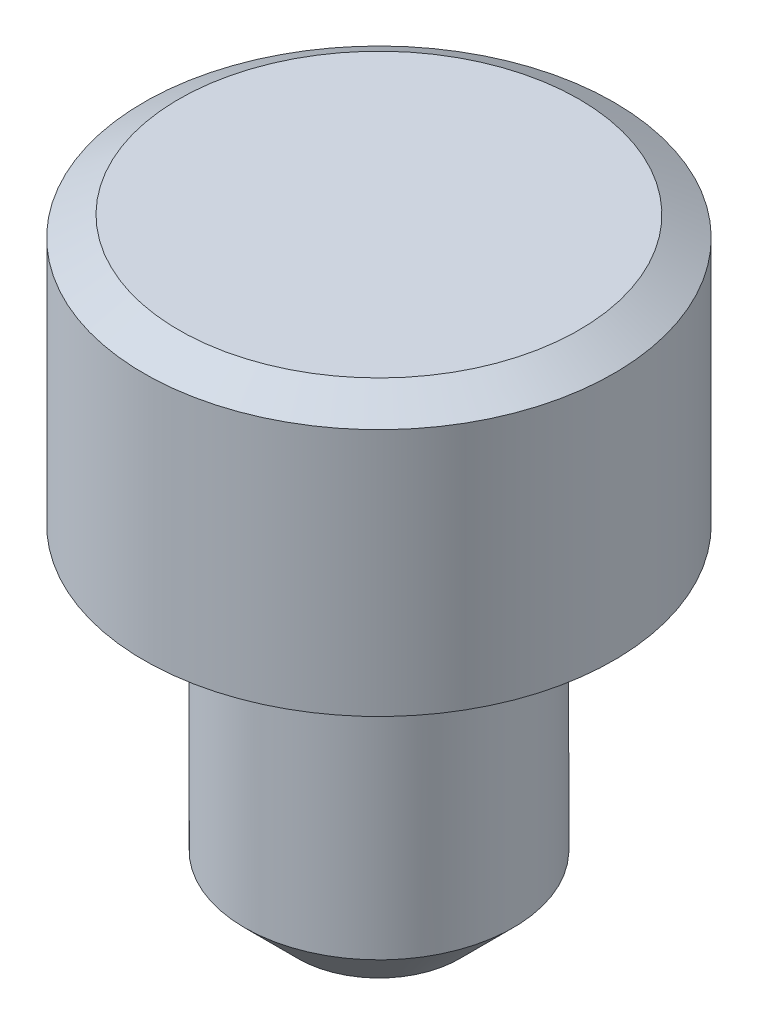
ISO-10303-21;
HEADER;
FILE_DESCRIPTION(('STEP AP214'),'2;1');
FILE_NAME('part.step','',(''),(''),'','','');
FILE_SCHEMA(('AUTOMOTIVE_DESIGN { 1 0 10303 214 1 1 1 1 }'));
ENDSEC;
DATA;
#1=APPLICATION_CONTEXT('core data for automotive mechanical design processes');
#2=APPLICATION_PROTOCOL_DEFINITION('international standard','automotive_design',2000,#1);
#3=PRODUCT_CONTEXT('',#1,'mechanical');
#4=PRODUCT('Part','Part','',(#3));
#5=PRODUCT_RELATED_PRODUCT_CATEGORY('part','',(#4));
#6=PRODUCT_DEFINITION_FORMATION('','',#4);
#7=PRODUCT_DEFINITION_CONTEXT('part definition',#1,'design');
#8=PRODUCT_DEFINITION('design','',#6,#7);
#9=PRODUCT_DEFINITION_SHAPE('','',#8);
#10=(LENGTH_UNIT() NAMED_UNIT(*) SI_UNIT(.MILLI.,.METRE.));
#11=(NAMED_UNIT(*) PLANE_ANGLE_UNIT() SI_UNIT($,.RADIAN.));
#12=(NAMED_UNIT(*) SI_UNIT($,.STERADIAN.) SOLID_ANGLE_UNIT());
#13=UNCERTAINTY_MEASURE_WITH_UNIT(LENGTH_MEASURE(1.E-05),#10,'distance_accuracy_value','');
#14=(GEOMETRIC_REPRESENTATION_CONTEXT(3) GLOBAL_UNCERTAINTY_ASSIGNED_CONTEXT((#13)) GLOBAL_UNIT_ASSIGNED_CONTEXT((#10,
#11,#12)) REPRESENTATION_CONTEXT('',''));
#15=CARTESIAN_POINT('',(0.,0.,0.));
#16=DIRECTION('',(0.,0.,1.));
#17=DIRECTION('',(1.,0.,0.));
#18=AXIS2_PLACEMENT_3D('',#15,#16,#17);
#19=CARTESIAN_POINT('',(0.,-5.,0.));
#20=DIRECTION('',(0.,-1.,0.));
#21=DIRECTION('',(0.,0.,-1.));
#22=AXIS2_PLACEMENT_3D('',#19,#20,#21);
#23=PLANE('',#22);
#24=CARTESIAN_POINT('',(0.,-4.99999999993861,0.));
#25=DIRECTION('',(0.,1.,0.));
#26=DIRECTION('',(0.,0.,1.));
#27=AXIS2_PLACEMENT_3D('',#24,#25,#26);
#28=CIRCLE('',#27,1.19999999998299);
#29=CARTESIAN_POINT('',(0.,-4.99999999993861,1.19999999998299));
#30=VERTEX_POINT('',#29);
#31=EDGE_CURVE('E91',#30,#30,#28,.T.);
#32=ORIENTED_EDGE('',*,*,#31,.F.);
#33=EDGE_LOOP('',(#32));
#34=FACE_BOUND('',#33,.T.);
#35=ADVANCED_FACE('F17',(#34),#23,.T.);
#36=CARTESIAN_POINT('',(0.,-4.1999999999689,0.));
#37=DIRECTION('',(0.,1.,0.));
#38=DIRECTION('',(0.,0.,1.));
#39=AXIS2_PLACEMENT_3D('',#36,#37,#38);
#40=CONICAL_SURFACE('',#39,1.99999999995271,0.785398163397448);
#41=CARTESIAN_POINT('',(0.,-4.2,0.));
#42=DIRECTION('',(0.,-1.,0.));
#43=DIRECTION('',(0.,0.,-1.));
#44=AXIS2_PLACEMENT_3D('',#41,#42,#43);
#45=CIRCLE('',#44,2.);
#46=CARTESIAN_POINT('',(0.,-4.2,-2.));
#47=VERTEX_POINT('',#46);
#48=EDGE_CURVE('E89',#47,#47,#45,.F.);
#49=ORIENTED_EDGE('',*,*,#48,.F.);
#50=EDGE_LOOP('',(#49));
#51=FACE_BOUND('',#50,.T.);
#52=ORIENTED_EDGE('',*,*,#31,.T.);
#53=EDGE_LOOP('',(#52));
#54=FACE_BOUND('',#53,.T.);
#55=ADVANCED_FACE('F97',(#51,#54),#40,.T.);
#56=CARTESIAN_POINT('',(0.,4.45,0.));
#57=DIRECTION('',(0.,-1.,0.));
#58=DIRECTION('',(0.,0.,-1.));
#59=AXIS2_PLACEMENT_3D('',#56,#57,#58);
#60=CYLINDRICAL_SURFACE('',#59,2.);
#61=CARTESIAN_POINT('',(0.,-0.2,0.));
#62=DIRECTION('',(0.,-1.,0.));
#63=DIRECTION('',(-1.,0.,0.));
#64=AXIS2_PLACEMENT_3D('',#61,#62,#63);
#65=CIRCLE('',#64,2.);
#66=CARTESIAN_POINT('',(-2.,-0.2,0.));
#67=VERTEX_POINT('',#66);
#68=EDGE_CURVE('E81',#67,#67,#65,.T.);
#69=ORIENTED_EDGE('',*,*,#68,.T.);
#70=EDGE_LOOP('',(#69));
#71=FACE_BOUND('',#70,.T.);
#72=ORIENTED_EDGE('',*,*,#48,.T.);
#73=EDGE_LOOP('',(#72));
#74=FACE_BOUND('',#73,.T.);
#75=ADVANCED_FACE('F104',(#71,#74),#60,.T.);
#76=CARTESIAN_POINT('',(0.,4.,0.));
#77=DIRECTION('',(0.,-1.,0.));
#78=DIRECTION('',(0.,0.,-1.));
#79=AXIS2_PLACEMENT_3D('',#76,#77,#78);
#80=PLANE('',#79);
#81=CARTESIAN_POINT('',(0.,4.00000000000151,0.));
#82=DIRECTION('',(0.,-1.,0.));
#83=DIRECTION('',(0.,0.,-1.));
#84=AXIS2_PLACEMENT_3D('',#81,#82,#83);
#85=CIRCLE('',#84,2.98038475779094);
#86=CARTESIAN_POINT('',(0.,4.00000000000151,-2.98038475779094));
#87=VERTEX_POINT('',#86);
#88=EDGE_CURVE('E42',#87,#87,#85,.T.);
#89=ORIENTED_EDGE('',*,*,#88,.F.);
#90=EDGE_LOOP('',(#89));
#91=FACE_BOUND('',#90,.T.);
#92=ADVANCED_FACE('F73',(#91),#80,.F.);
#93=CARTESIAN_POINT('',(0.,-0.2,0.));
#94=DIRECTION('',(0.,-1.,0.));
#95=DIRECTION('',(-1.,0.,0.));
#96=AXIS2_PLACEMENT_3D('',#93,#94,#95);
#97=TOROIDAL_SURFACE('',#96,2.2,0.2);
#98=CARTESIAN_POINT('',(0.,0.,0.));
#99=DIRECTION('',(0.,-1.,0.));
#100=DIRECTION('',(-1.,0.,0.));
#101=AXIS2_PLACEMENT_3D('',#98,#99,#100);
#102=CIRCLE('',#101,2.2);
#103=CARTESIAN_POINT('',(2.2,0.,0.));
#104=VERTEX_POINT('',#103);
#105=CARTESIAN_POINT('',(-2.2,0.,0.));
#106=VERTEX_POINT('',#105);
#107=EDGE_CURVE('E34',#104,#106,#102,.F.);
#108=ORIENTED_EDGE('',*,*,#107,.F.);
#109=CARTESIAN_POINT('',(0.,0.,0.));
#110=DIRECTION('',(0.,-1.,0.));
#111=DIRECTION('',(1.,0.,0.));
#112=AXIS2_PLACEMENT_3D('',#109,#110,#111);
#113=CIRCLE('',#112,2.2);
#114=EDGE_CURVE('E37',#106,#104,#113,.F.);
#115=ORIENTED_EDGE('',*,*,#114,.F.);
#116=EDGE_LOOP('',(#108,#115));
#117=FACE_BOUND('',#116,.T.);
#118=ORIENTED_EDGE('',*,*,#68,.F.);
#119=EDGE_LOOP('',(#118));
#120=FACE_BOUND('',#119,.T.);
#121=ADVANCED_FACE('F38',(#117,#120),#97,.F.);
#122=CARTESIAN_POINT('',(0.,3.70000000015125,0.));
#123=DIRECTION('',(0.,-1.,0.));
#124=DIRECTION('',(0.,0.,-1.));
#125=AXIS2_PLACEMENT_3D('',#122,#123,#124);
#126=CONICAL_SURFACE('',#125,3.49999999980355,1.04719755119768);
#127=CARTESIAN_POINT('',(0.,3.7,0.));
#128=DIRECTION('',(0.,-1.,0.));
#129=DIRECTION('',(0.,0.,-1.));
#130=AXIS2_PLACEMENT_3D('',#127,#128,#129);
#131=CIRCLE('',#130,3.5);
#132=CARTESIAN_POINT('',(0.,3.7,-3.5));
#133=VERTEX_POINT('',#132);
#134=EDGE_CURVE('E27',#133,#133,#131,.T.);
#135=ORIENTED_EDGE('',*,*,#134,.F.);
#136=EDGE_LOOP('',(#135));
#137=FACE_BOUND('',#136,.T.);
#138=ORIENTED_EDGE('',*,*,#88,.T.);
#139=EDGE_LOOP('',(#138));
#140=FACE_BOUND('',#139,.T.);
#141=ADVANCED_FACE('F66',(#137,#140),#126,.T.);
#142=CARTESIAN_POINT('',(0.,0.,0.));
#143=DIRECTION('',(0.,-1.,0.));
#144=DIRECTION('',(0.,0.,-1.));
#145=AXIS2_PLACEMENT_3D('',#142,#143,#144);
#146=PLANE('',#145);
#147=ORIENTED_EDGE('',*,*,#114,.T.);
#148=ORIENTED_EDGE('',*,*,#107,.T.);
#149=EDGE_LOOP('',(#147,#148));
#150=FACE_BOUND('',#149,.T.);
#151=CARTESIAN_POINT('',(0.,0.,0.));
#152=DIRECTION('',(0.,-1.,0.));
#153=DIRECTION('',(0.,0.,-1.));
#154=AXIS2_PLACEMENT_3D('',#151,#152,#153);
#155=CIRCLE('',#154,3.5);
#156=CARTESIAN_POINT('',(0.,0.,-3.5));
#157=VERTEX_POINT('',#156);
#158=EDGE_CURVE('E11',#157,#157,#155,.F.);
#159=ORIENTED_EDGE('',*,*,#158,.F.);
#160=EDGE_LOOP('',(#159));
#161=FACE_BOUND('',#160,.T.);
#162=ADVANCED_FACE('F45',(#150,#161),#146,.T.);
#163=CARTESIAN_POINT('',(0.,4.45,0.));
#164=DIRECTION('',(0.,-1.,0.));
#165=DIRECTION('',(0.,0.,-1.));
#166=AXIS2_PLACEMENT_3D('',#163,#164,#165);
#167=CYLINDRICAL_SURFACE('',#166,3.5);
#168=ORIENTED_EDGE('',*,*,#158,.T.);
#169=EDGE_LOOP('',(#168));
#170=FACE_BOUND('',#169,.T.);
#171=ORIENTED_EDGE('',*,*,#134,.T.);
#172=EDGE_LOOP('',(#171));
#173=FACE_BOUND('',#172,.T.);
#174=ADVANCED_FACE('F65',(#170,#173),#167,.T.);
#175=CLOSED_SHELL('',(#35,#55,#75,#92,#121,#141,#162,#174));
#176=MANIFOLD_SOLID_BREP('B1',#175);
#177=ADVANCED_BREP_SHAPE_REPRESENTATION('',(#18,#176),#14);
#178=SHAPE_DEFINITION_REPRESENTATION(#9,#177);
ENDSEC;
END-ISO-10303-21;
